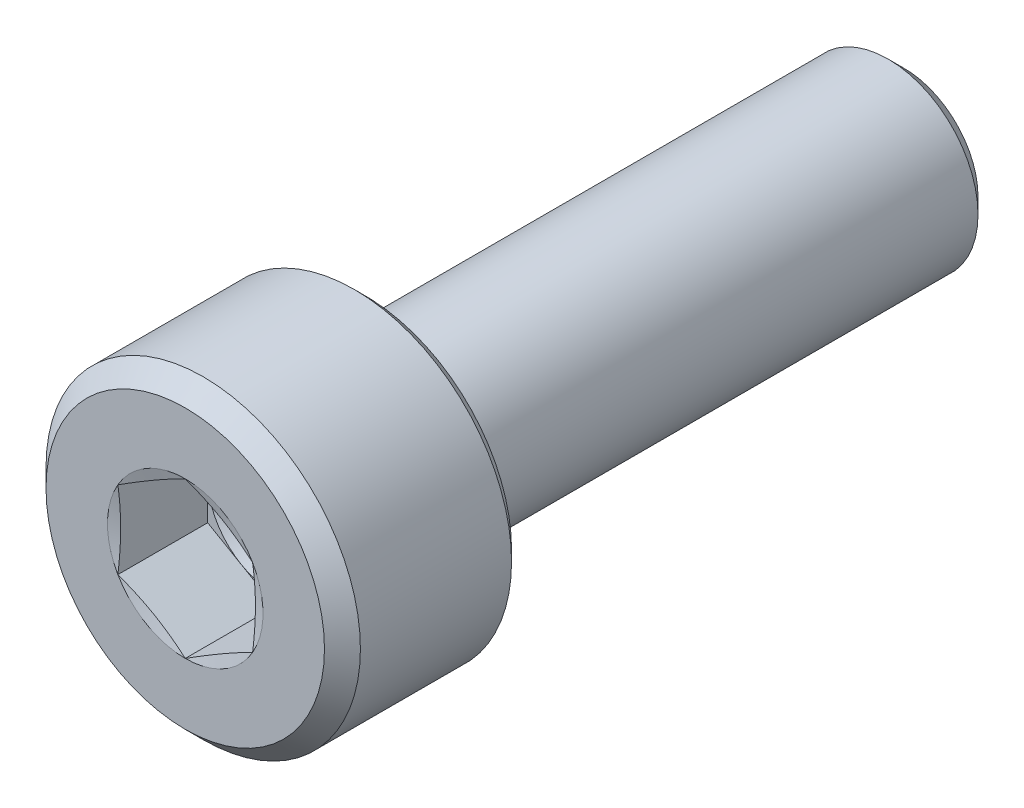
ISO-10303-21;
HEADER;
FILE_DESCRIPTION(('STEP AP214'),'2;1');
FILE_NAME('part.step','',(''),(''),'','','');
FILE_SCHEMA(('AUTOMOTIVE_DESIGN { 1 0 10303 214 1 1 1 1 }'));
ENDSEC;
DATA;
#1=APPLICATION_CONTEXT('core data for automotive mechanical design processes');
#2=APPLICATION_PROTOCOL_DEFINITION('international standard','automotive_design',2000,#1);
#3=PRODUCT_CONTEXT('',#1,'mechanical');
#4=PRODUCT('Part','Part','',(#3));
#5=PRODUCT_RELATED_PRODUCT_CATEGORY('part','',(#4));
#6=PRODUCT_DEFINITION_FORMATION('','',#4);
#7=PRODUCT_DEFINITION_CONTEXT('part definition',#1,'design');
#8=PRODUCT_DEFINITION('design','',#6,#7);
#9=PRODUCT_DEFINITION_SHAPE('','',#8);
#10=(LENGTH_UNIT() NAMED_UNIT(*) SI_UNIT(.MILLI.,.METRE.));
#11=(NAMED_UNIT(*) PLANE_ANGLE_UNIT() SI_UNIT($,.RADIAN.));
#12=(NAMED_UNIT(*) SI_UNIT($,.STERADIAN.) SOLID_ANGLE_UNIT());
#13=UNCERTAINTY_MEASURE_WITH_UNIT(LENGTH_MEASURE(1.E-05),#10,'distance_accuracy_value','');
#14=(GEOMETRIC_REPRESENTATION_CONTEXT(3) GLOBAL_UNCERTAINTY_ASSIGNED_CONTEXT((#13)) GLOBAL_UNIT_ASSIGNED_CONTEXT((#10,
#11,#12)) REPRESENTATION_CONTEXT('',''));
#15=CARTESIAN_POINT('',(0.,0.,0.));
#16=DIRECTION('',(0.,0.,1.));
#17=DIRECTION('',(1.,0.,0.));
#18=AXIS2_PLACEMENT_3D('',#15,#16,#17);
#19=CARTESIAN_POINT('',(0.,0.,0.));
#20=DIRECTION('',(0.,0.,-1.));
#21=DIRECTION('',(-1.,0.,0.));
#22=AXIS2_PLACEMENT_3D('',#19,#20,#21);
#23=PLANE('',#22);
#24=CARTESIAN_POINT('',(0.,0.,0.));
#25=DIRECTION('',(0.,0.,1.));
#26=DIRECTION('',(1.,0.,0.));
#27=AXIS2_PLACEMENT_3D('',#24,#25,#26);
#28=CIRCLE('',#27,3.1);
#29=CARTESIAN_POINT('',(3.1,0.,0.));
#30=VERTEX_POINT('',#29);
#31=EDGE_CURVE('E229',#30,#30,#28,.T.);
#32=ORIENTED_EDGE('',*,*,#31,.T.);
#33=EDGE_LOOP('',(#32));
#34=FACE_BOUND('',#33,.T.);
#35=CARTESIAN_POINT('',(0.,0.,0.));
#36=DIRECTION('',(0.,0.,1.));
#37=DIRECTION('',(1.,0.,0.));
#38=AXIS2_PLACEMENT_3D('',#35,#36,#37);
#39=CIRCLE('',#38,1.73205080756888);
#40=CARTESIAN_POINT('',(-1.5,-0.866025403784441,0.));
#41=VERTEX_POINT('',#40);
#42=CARTESIAN_POINT('',(0.,-1.73205080756888,0.));
#43=VERTEX_POINT('',#42);
#44=EDGE_CURVE('E155',#41,#43,#39,.T.);
#45=ORIENTED_EDGE('',*,*,#44,.F.);
#46=CARTESIAN_POINT('',(-1.5,0.86602540378444,0.));
#47=VERTEX_POINT('',#46);
#48=EDGE_CURVE('E154',#47,#41,#39,.T.);
#49=ORIENTED_EDGE('',*,*,#48,.F.);
#50=CARTESIAN_POINT('',(0.,1.73205080756888,0.));
#51=VERTEX_POINT('',#50);
#52=EDGE_CURVE('E121',#51,#47,#39,.T.);
#53=ORIENTED_EDGE('',*,*,#52,.F.);
#54=CARTESIAN_POINT('',(1.5,0.86602540378444,0.));
#55=VERTEX_POINT('',#54);
#56=EDGE_CURVE('E115',#55,#51,#39,.T.);
#57=ORIENTED_EDGE('',*,*,#56,.F.);
#58=CARTESIAN_POINT('',(1.5,-0.866025403784438,0.));
#59=VERTEX_POINT('',#58);
#60=EDGE_CURVE('E123',#59,#55,#39,.T.);
#61=ORIENTED_EDGE('',*,*,#60,.F.);
#62=EDGE_CURVE('E313',#43,#59,#39,.T.);
#63=ORIENTED_EDGE('',*,*,#62,.F.);
#64=EDGE_LOOP('',(#45,#49,#53,#57,#61,#63));
#65=FACE_BOUND('',#64,.T.);
#66=ADVANCED_FACE('F38',(#34,#65),#23,.F.);
#67=CARTESIAN_POINT('',(0.,0.,-0.4));
#68=DIRECTION('',(0.,0.,-1.));
#69=DIRECTION('',(-1.,0.,0.));
#70=AXIS2_PLACEMENT_3D('',#67,#68,#69);
#71=CONICAL_SURFACE('',#70,3.5,0.78539816339745);
#72=ORIENTED_EDGE('',*,*,#31,.F.);
#73=EDGE_LOOP('',(#72));
#74=FACE_BOUND('',#73,.T.);
#75=CARTESIAN_POINT('',(0.,0.,-0.4));
#76=DIRECTION('',(0.,0.,1.));
#77=DIRECTION('',(1.,0.,0.));
#78=AXIS2_PLACEMENT_3D('',#75,#76,#77);
#79=CIRCLE('',#78,3.5);
#80=CARTESIAN_POINT('',(3.5,0.,-0.4));
#81=VERTEX_POINT('',#80);
#82=EDGE_CURVE('E231',#81,#81,#79,.T.);
#83=ORIENTED_EDGE('',*,*,#82,.T.);
#84=EDGE_LOOP('',(#83));
#85=FACE_BOUND('',#84,.T.);
#86=ADVANCED_FACE('F220',(#74,#85),#71,.T.);
#87=CARTESIAN_POINT('',(0.,0.,0.));
#88=DIRECTION('',(0.,0.,1.));
#89=DIRECTION('',(1.,0.,0.));
#90=AXIS2_PLACEMENT_3D('',#87,#88,#89);
#91=CYLINDRICAL_SURFACE('',#90,3.5);
#92=ORIENTED_EDGE('',*,*,#82,.F.);
#93=EDGE_LOOP('',(#92));
#94=FACE_BOUND('',#93,.T.);
#95=CARTESIAN_POINT('',(0.,0.,-3.765));
#96=DIRECTION('',(0.,0.,1.));
#97=DIRECTION('',(1.,0.,0.));
#98=AXIS2_PLACEMENT_3D('',#95,#96,#97);
#99=CIRCLE('',#98,3.5);
#100=CARTESIAN_POINT('',(3.5,0.,-3.765));
#101=VERTEX_POINT('',#100);
#102=EDGE_CURVE('E234',#101,#101,#99,.T.);
#103=ORIENTED_EDGE('',*,*,#102,.T.);
#104=EDGE_LOOP('',(#103));
#105=FACE_BOUND('',#104,.T.);
#106=ADVANCED_FACE('F225',(#94,#105),#91,.T.);
#107=CARTESIAN_POINT('',(0.,0.,-4.));
#108=DIRECTION('',(0.,0.,1.));
#109=DIRECTION('',(1.,0.,0.));
#110=AXIS2_PLACEMENT_3D('',#107,#108,#109);
#111=CONICAL_SURFACE('',#110,3.265,0.78539816339745);
#112=ORIENTED_EDGE('',*,*,#102,.F.);
#113=EDGE_LOOP('',(#112));
#114=FACE_BOUND('',#113,.T.);
#115=CARTESIAN_POINT('',(0.,0.,-4.));
#116=DIRECTION('',(0.,0.,1.));
#117=DIRECTION('',(1.,0.,0.));
#118=AXIS2_PLACEMENT_3D('',#115,#116,#117);
#119=CIRCLE('',#118,3.265);
#120=CARTESIAN_POINT('',(3.265,0.,-4.));
#121=VERTEX_POINT('',#120);
#122=EDGE_CURVE('E239',#121,#121,#119,.T.);
#123=ORIENTED_EDGE('',*,*,#122,.T.);
#124=EDGE_LOOP('',(#123));
#125=FACE_BOUND('',#124,.T.);
#126=ADVANCED_FACE('F429',(#114,#125),#111,.T.);
#127=CARTESIAN_POINT('',(0.,3.265,-4.));
#128=DIRECTION('',(0.,0.,1.));
#129=DIRECTION('',(1.,0.,0.));
#130=AXIS2_PLACEMENT_3D('',#127,#128,#129);
#131=PLANE('',#130);
#132=ORIENTED_EDGE('',*,*,#122,.F.);
#133=EDGE_LOOP('',(#132));
#134=FACE_BOUND('',#133,.T.);
#135=CARTESIAN_POINT('',(0.,0.,-4.));
#136=DIRECTION('',(0.,0.,1.));
#137=DIRECTION('',(1.,0.,0.));
#138=AXIS2_PLACEMENT_3D('',#135,#136,#137);
#139=CIRCLE('',#138,2.35);
#140=CARTESIAN_POINT('',(2.35,0.,-4.));
#141=VERTEX_POINT('',#140);
#142=EDGE_CURVE('E242',#141,#141,#139,.T.);
#143=ORIENTED_EDGE('',*,*,#142,.T.);
#144=EDGE_LOOP('',(#143));
#145=FACE_BOUND('',#144,.T.);
#146=ADVANCED_FACE('F421',(#134,#145),#131,.F.);
#147=CARTESIAN_POINT('',(0.,0.,-4.2));
#148=DIRECTION('',(0.,0.,1.));
#149=DIRECTION('',(1.,0.,0.));
#150=AXIS2_PLACEMENT_3D('',#147,#148,#149);
#151=TOROIDAL_SURFACE('',#150,2.35,0.199999999999999);
#152=ORIENTED_EDGE('',*,*,#142,.F.);
#153=EDGE_LOOP('',(#152));
#154=FACE_BOUND('',#153,.T.);
#155=CARTESIAN_POINT('',(0.,0.,-4.12977531168232));
#156=DIRECTION('',(0.,0.,1.));
#157=DIRECTION('',(1.,0.,0.));
#158=AXIS2_PLACEMENT_3D('',#155,#156,#157);
#159=CIRCLE('',#158,2.16273416448619);
#160=CARTESIAN_POINT('',(2.16273416448619,0.,-4.12977531168232));
#161=VERTEX_POINT('',#160);
#162=EDGE_CURVE('E245',#161,#161,#159,.T.);
#163=ORIENTED_EDGE('',*,*,#162,.T.);
#164=EDGE_LOOP('',(#163));
#165=FACE_BOUND('',#164,.T.);
#166=ADVANCED_FACE('F413',(#154,#165),#151,.F.);
#167=CARTESIAN_POINT('',(0.,0.,-4.52977531168232));
#168=DIRECTION('',(0.,0.,1.));
#169=DIRECTION('',(1.,0.,0.));
#170=AXIS2_PLACEMENT_3D('',#167,#168,#169);
#171=CONICAL_SURFACE('',#170,2.01273416448619,0.358770670270571);
#172=ORIENTED_EDGE('',*,*,#162,.F.);
#173=EDGE_LOOP('',(#172));
#174=FACE_BOUND('',#173,.T.);
#175=CARTESIAN_POINT('',(0.,0.,-4.52977531168232));
#176=DIRECTION('',(0.,0.,1.));
#177=DIRECTION('',(1.,0.,0.));
#178=AXIS2_PLACEMENT_3D('',#175,#176,#177);
#179=CIRCLE('',#178,2.01273416448619);
#180=CARTESIAN_POINT('',(2.01273416448619,0.,-4.52977531168232));
#181=VERTEX_POINT('',#180);
#182=EDGE_CURVE('E248',#181,#181,#179,.T.);
#183=ORIENTED_EDGE('',*,*,#182,.T.);
#184=EDGE_LOOP('',(#183));
#185=FACE_BOUND('',#184,.T.);
#186=ADVANCED_FACE('F405',(#174,#185),#171,.T.);
#187=CARTESIAN_POINT('',(0.,0.,-4.6));
#188=DIRECTION('',(0.,0.,1.));
#189=DIRECTION('',(1.,0.,0.));
#190=AXIS2_PLACEMENT_3D('',#187,#188,#189);
#191=TOROIDAL_SURFACE('',#190,2.2,0.199999999999999);
#192=ORIENTED_EDGE('',*,*,#182,.F.);
#193=EDGE_LOOP('',(#192));
#194=FACE_BOUND('',#193,.T.);
#195=CARTESIAN_POINT('',(0.,0.,-4.6));
#196=DIRECTION('',(0.,0.,1.));
#197=DIRECTION('',(1.,0.,0.));
#198=AXIS2_PLACEMENT_3D('',#195,#196,#197);
#199=CIRCLE('',#198,2.);
#200=CARTESIAN_POINT('',(2.,0.,-4.6));
#201=VERTEX_POINT('',#200);
#202=EDGE_CURVE('E251',#201,#201,#199,.T.);
#203=ORIENTED_EDGE('',*,*,#202,.T.);
#204=EDGE_LOOP('',(#203));
#205=FACE_BOUND('',#204,.T.);
#206=ADVANCED_FACE('F397',(#194,#205),#191,.F.);
#207=CARTESIAN_POINT('',(0.,0.,0.));
#208=DIRECTION('',(0.,0.,1.));
#209=DIRECTION('',(1.,0.,0.));
#210=AXIS2_PLACEMENT_3D('',#207,#208,#209);
#211=CYLINDRICAL_SURFACE('',#210,2.);
#212=ORIENTED_EDGE('',*,*,#202,.F.);
#213=EDGE_LOOP('',(#212));
#214=FACE_BOUND('',#213,.T.);
#215=CARTESIAN_POINT('',(0.,0.,-15.65));
#216=DIRECTION('',(0.,0.,1.));
#217=DIRECTION('',(1.,0.,0.));
#218=AXIS2_PLACEMENT_3D('',#215,#216,#217);
#219=CIRCLE('',#218,2.);
#220=CARTESIAN_POINT('',(2.,0.,-15.65));
#221=VERTEX_POINT('',#220);
#222=EDGE_CURVE('E254',#221,#221,#219,.T.);
#223=ORIENTED_EDGE('',*,*,#222,.T.);
#224=EDGE_LOOP('',(#223));
#225=FACE_BOUND('',#224,.T.);
#226=ADVANCED_FACE('F388',(#214,#225),#211,.T.);
#227=CARTESIAN_POINT('',(0.,0.,-16.));
#228=DIRECTION('',(0.,0.,1.));
#229=DIRECTION('',(1.,0.,0.));
#230=AXIS2_PLACEMENT_3D('',#227,#228,#229);
#231=CONICAL_SURFACE('',#230,1.65,0.785398163397434);
#232=ORIENTED_EDGE('',*,*,#222,.F.);
#233=EDGE_LOOP('',(#232));
#234=FACE_BOUND('',#233,.T.);
#235=CARTESIAN_POINT('',(0.,0.,-16.));
#236=DIRECTION('',(0.,0.,1.));
#237=DIRECTION('',(1.,0.,0.));
#238=AXIS2_PLACEMENT_3D('',#235,#236,#237);
#239=CIRCLE('',#238,1.65);
#240=CARTESIAN_POINT('',(1.65,0.,-16.));
#241=VERTEX_POINT('',#240);
#242=EDGE_CURVE('E257',#241,#241,#239,.T.);
#243=ORIENTED_EDGE('',*,*,#242,.T.);
#244=EDGE_LOOP('',(#243));
#245=FACE_BOUND('',#244,.T.);
#246=ADVANCED_FACE('F380',(#234,#245),#231,.T.);
#247=CARTESIAN_POINT('',(0.,1.65,-16.));
#248=DIRECTION('',(0.,0.,1.));
#249=DIRECTION('',(1.,0.,0.));
#250=AXIS2_PLACEMENT_3D('',#247,#248,#249);
#251=PLANE('',#250);
#252=ORIENTED_EDGE('',*,*,#242,.F.);
#253=EDGE_LOOP('',(#252));
#254=FACE_BOUND('',#253,.T.);
#255=ADVANCED_FACE('F374',(#254),#251,.F.);
#256=CARTESIAN_POINT('',(0.,0.,-0.0621778264910692));
#257=DIRECTION('',(0.,0.,1.));
#258=DIRECTION('',(1.,0.,0.));
#259=AXIS2_PLACEMENT_3D('',#256,#257,#258);
#260=CONICAL_SURFACE('',#259,1.5,1.30899693899575);
#261=ORIENTED_EDGE('',*,*,#52,.T.);
#262=CARTESIAN_POINT('',(-1.5002,0.865909933730602,3.09432014802828E-05));
#263=CARTESIAN_POINT('',(-1.43789222061942,0.901883346928587,-0.00961367357160753));
#264=CARTESIAN_POINT('',(-1.37547144481682,0.937921998641243,-0.0183695040280942));
#265=CARTESIAN_POINT('',(-1.25040937601299,1.01012661773055,-0.0337528099860755));
#266=CARTESIAN_POINT('',(-1.18776800380528,1.04629263083708,-0.0403794203637019));
#267=CARTESIAN_POINT('',(-1.06264466889024,1.11853262193218,-0.0511173105510228));
#268=CARTESIAN_POINT('',(-1.00016355288116,1.15460611107929,-0.0552413999954297));
#269=CARTESIAN_POINT('',(-0.875121612727221,1.22679910888716,-0.0607713948192355));
#270=CARTESIAN_POINT('',(-0.81256080636361,1.26291860728191,-0.0621778264910689));
#271=CARTESIAN_POINT('',(-0.687439193636389,1.33515760407141,-0.0621778264910689));
#272=CARTESIAN_POINT('',(-0.624878387272779,1.37127710246616,-0.0607713948192355));
#273=CARTESIAN_POINT('',(-0.499836447118839,1.44347010027403,-0.0552413999954297));
#274=CARTESIAN_POINT('',(-0.437355331109757,1.47954358942114,-0.0511173105510227));
#275=CARTESIAN_POINT('',(-0.312231996194721,1.55178358051624,-0.0403794203637018));
#276=CARTESIAN_POINT('',(-0.249590623987014,1.58794959362277,-0.0337528099860754));
#277=CARTESIAN_POINT('',(-0.124528555183177,1.66015421271208,-0.0183695040280941));
#278=CARTESIAN_POINT('',(-0.0621077793805777,1.69619286442473,-0.00961367357160735));
#279=CARTESIAN_POINT('',(0.000200000000000538,1.73216627762272,3.09432014804724E-05));
#280=B_SPLINE_CURVE_WITH_KNOTS('',3,(#262,#263,#264,#265,#266,#267,#268,#269,#270,#271,#272,
#273,#274,#275,#276,#277,#278,#279),.UNSPECIFIED.,.F.,.F.,(4,2,2,2,2,2,2,2,4),(0.,
0.217782584290281,0.435653544301782,0.652399669875338,0.869103816917188,1.08580796395904,
1.30255408953259,1.52042504954409,1.73820763383438),.UNSPECIFIED.);
#281=EDGE_CURVE('E11',#47,#51,#280,.T.);
#282=ORIENTED_EDGE('',*,*,#281,.T.);
#283=EDGE_LOOP('',(#261,#282));
#284=FACE_BOUND('',#283,.T.);
#285=ADVANCED_FACE('F127',(#284),#260,.F.);
#286=CARTESIAN_POINT('',(-1.5,-2.28964517247226,0.269339250493358));
#287=CARTESIAN_POINT('',(-1.5,-2.22160925580753,0.254092485074887));
#288=CARTESIAN_POINT('',(-1.5,-2.15353089636947,0.239034964401491));
#289=CARTESIAN_POINT('',(-1.5,-2.01726808230002,0.209394014326251));
#290=CARTESIAN_POINT('',(-1.5,-1.94908362321089,0.194810605440343));
#291=CARTESIAN_POINT('',(-1.5,-1.74421629402713,0.15188930467263));
#292=CARTESIAN_POINT('',(-1.5,-1.60735081315243,0.124410160848443));
#293=CARTESIAN_POINT('',(-1.5,-1.33404872260703,0.0731505368877311));
#294=CARTESIAN_POINT('',(-1.5,-1.19761743420633,0.0493422393460058));
#295=CARTESIAN_POINT('',(-1.5,-0.923938172131804,0.00699912407182039));
#296=CARTESIAN_POINT('',(-1.5,-0.786690344875856,-0.0115366116465929));
#297=CARTESIAN_POINT('',(-1.5,-0.509744520865001,-0.0409708681025398));
#298=CARTESIAN_POINT('',(-1.5,-0.370036362636702,-0.0517807181835124));
#299=CARTESIAN_POINT('',(-1.5,-0.160199252563518,-0.0603214648098066));
#300=CARTESIAN_POINT('',(-1.5,-0.0902193139362214,-0.0618897497676771));
#301=CARTESIAN_POINT('',(-1.5,0.049751791494376,-0.0623927733659913));
#302=CARTESIAN_POINT('',(-1.5,0.119742958288953,-0.0613275140426648));
#303=CARTESIAN_POINT('',(-1.5,0.259888881116302,-0.0566175514896631));
#304=CARTESIAN_POINT('',(-1.5,0.330043318264885,-0.0529635706300794));
#305=CARTESIAN_POINT('',(-1.5,0.470190940626507,-0.0432854694959674));
#306=CARTESIAN_POINT('',(-1.5,0.540184111252621,-0.0372611426780542));
#307=CARTESIAN_POINT('',(-1.5,0.749926987666925,-0.0160904435214203));
#308=CARTESIAN_POINT('',(-1.5,0.88936353865627,0.0021504551344671));
#309=CARTESIAN_POINT('',(-1.5,1.15801626262229,0.042848348608772));
#310=CARTESIAN_POINT('',(-1.5,1.28729075030016,0.0649405727898832));
#311=CARTESIAN_POINT('',(-1.5,1.54524807848696,0.11239508941207));
#312=CARTESIAN_POINT('',(-1.5,1.67393084218421,0.137757794638382));
#313=CARTESIAN_POINT('',(-1.5,1.9308654649173,0.190676592918979));
#314=CARTESIAN_POINT('',(-1.5,2.05911723183815,0.218233127195528));
#315=CARTESIAN_POINT('',(-1.5,2.31529096225887,0.274842718879562));
#316=CARTESIAN_POINT('',(-1.5,2.44321291887911,0.303895807243219));
#317=CARTESIAN_POINT('',(-1.5,2.69755167278246,0.362760576516848));
#318=CARTESIAN_POINT('',(-1.5,2.82397086776101,0.392561944472507));
#319=CARTESIAN_POINT('',(-1.5,3.07663292781285,0.452911245733353));
#320=CARTESIAN_POINT('',(-1.5,3.20287578964328,0.483459192582276));
#321=CARTESIAN_POINT('',(-1.5,3.45507130559321,0.545068721241145));
#322=CARTESIAN_POINT('',(-1.5,3.58102412567918,0.576129625174751));
#323=CARTESIAN_POINT('',(-1.5,3.83282000513678,0.638675885363819));
#324=CARTESIAN_POINT('',(-1.5,3.95866306798554,0.670161227611327));
#325=CARTESIAN_POINT('',(-1.5,4.08446786908827,0.70179695066207));
#326=B_SPLINE_CURVE_WITH_KNOTS('',3,(#286,#287,#288,#289,#290,#291,#292,#293,#294,#295,#296,
#297,#298,#299,#300,#301,#302,#303,#304,#305,#306,#307,#308,#309,#310,#311,#312,#313,#314,#315,
#316,#317,#318,#319,#320,#321,#322,#323,#324,#325),.UNSPECIFIED.,.F.,.F.,(4,2,2,2,2,2,2,2,2,2,2,
2,2,2,2,2,2,2,2,4),(0.,0.209169579296721,0.418348197839629,0.837109447697196,1.25252230864062,
1.66786279927901,2.08789680755374,2.29784449547574,2.50779202106835,2.71849580165408,
2.92921794627363,3.35089158040197,3.74428720392395,4.13773252874107,4.53125718404496,
4.92478998266471,5.31443997631384,5.70409704388357,6.09327490648975,6.48243995615359),.UNSPECIFIED.);
#327=EDGE_CURVE('E120',#41,#47,#326,.T.);
#328=ORIENTED_EDGE('',*,*,#327,.T.);
#329=ORIENTED_EDGE('',*,*,#48,.T.);
#330=EDGE_LOOP('',(#328,#329));
#331=FACE_BOUND('',#330,.T.);
#332=ADVANCED_FACE('F361',(#331),#260,.F.);
#333=CARTESIAN_POINT('',(0.000199999999999819,-1.73216627762271,3.09432014800229E-05));
#334=CARTESIAN_POINT('',(-0.0621077793805785,-1.69619286442473,-0.00961367357160781));
#335=CARTESIAN_POINT('',(-0.124528555183178,-1.66015421271207,-0.0183695040280945));
#336=CARTESIAN_POINT('',(-0.249590623987014,-1.58794959362277,-0.0337528099860759));
#337=CARTESIAN_POINT('',(-0.312231996194721,-1.55178358051624,-0.0403794203637023));
#338=CARTESIAN_POINT('',(-0.437355331109758,-1.47954358942114,-0.0511173105510232));
#339=CARTESIAN_POINT('',(-0.499836447118839,-1.44347010027403,-0.0552413999954301));
#340=CARTESIAN_POINT('',(-0.624878387272779,-1.37127710246616,-0.0607713948192359));
#341=CARTESIAN_POINT('',(-0.68743919363639,-1.33515760407141,-0.0621778264910694));
#342=CARTESIAN_POINT('',(-0.81256080636361,-1.26291860728191,-0.0621778264910694));
#343=CARTESIAN_POINT('',(-0.875121612727221,-1.22679910888716,-0.0607713948192359));
#344=CARTESIAN_POINT('',(-1.00016355288116,-1.15460611107929,-0.0552413999954301));
#345=CARTESIAN_POINT('',(-1.06264466889024,-1.11853262193217,-0.0511173105510231));
#346=CARTESIAN_POINT('',(-1.18776800380528,-1.04629263083707,-0.0403794203637023));
#347=CARTESIAN_POINT('',(-1.25040937601299,-1.01012661773055,-0.0337528099860759));
#348=CARTESIAN_POINT('',(-1.37547144481682,-0.937921998641241,-0.0183695040280945));
#349=CARTESIAN_POINT('',(-1.43789222061942,-0.901883346928585,-0.00961367357160784));
#350=CARTESIAN_POINT('',(-1.5002,-0.8659099337306,3.09432014799995E-05));
#351=B_SPLINE_CURVE_WITH_KNOTS('',3,(#333,#334,#335,#336,#337,#338,#339,#340,#341,#342,#343,
#344,#345,#346,#347,#348,#349,#350),.UNSPECIFIED.,.F.,.F.,(4,2,2,2,2,2,2,2,4),(0.,
0.217782584290281,0.435653544301782,0.652399669875338,0.869103816917187,1.08580796395904,
1.30255408953259,1.52042504954409,1.73820763383437),.UNSPECIFIED.);
#352=EDGE_CURVE('E163',#43,#41,#351,.T.);
#353=ORIENTED_EDGE('',*,*,#352,.T.);
#354=ORIENTED_EDGE('',*,*,#44,.T.);
#355=EDGE_LOOP('',(#353,#354));
#356=FACE_BOUND('',#355,.T.);
#357=ADVANCED_FACE('F355',(#356),#260,.F.);
#358=CARTESIAN_POINT('',(1.5002,-0.865909933730601,3.09432014800545E-05));
#359=CARTESIAN_POINT('',(1.43789222061942,-0.901883346928586,-0.00961367357160779));
#360=CARTESIAN_POINT('',(1.37547144481682,-0.937921998641241,-0.0183695040280945));
#361=CARTESIAN_POINT('',(1.25040937601299,-1.01012661773055,-0.0337528099860758));
#362=CARTESIAN_POINT('',(1.18776800380528,-1.04629263083708,-0.0403794203637023));
#363=CARTESIAN_POINT('',(1.06264466889024,-1.11853262193217,-0.0511173105510231));
#364=CARTESIAN_POINT('',(1.00016355288116,-1.15460611107929,-0.0552413999954301));
#365=CARTESIAN_POINT('',(0.875121612727221,-1.22679910888716,-0.0607713948192359));
#366=CARTESIAN_POINT('',(0.81256080636361,-1.26291860728191,-0.0621778264910693));
#367=CARTESIAN_POINT('',(0.687439193636389,-1.33515760407141,-0.0621778264910693));
#368=CARTESIAN_POINT('',(0.624878387272779,-1.37127710246616,-0.0607713948192359));
#369=CARTESIAN_POINT('',(0.499836447118839,-1.44347010027403,-0.0552413999954301));
#370=CARTESIAN_POINT('',(0.437355331109758,-1.47954358942114,-0.0511173105510231));
#371=CARTESIAN_POINT('',(0.312231996194721,-1.55178358051624,-0.0403794203637023));
#372=CARTESIAN_POINT('',(0.249590623987014,-1.58794959362277,-0.0337528099860758));
#373=CARTESIAN_POINT('',(0.124528555183178,-1.66015421271207,-0.0183695040280946));
#374=CARTESIAN_POINT('',(0.0621077793805782,-1.69619286442473,-0.00961367357160789));
#375=CARTESIAN_POINT('',(-0.000200000000000048,-1.73216627762271,3.09432014798939E-05));
#376=B_SPLINE_CURVE_WITH_KNOTS('',3,(#358,#359,#360,#361,#362,#363,#364,#365,#366,#367,#368,
#369,#370,#371,#372,#373,#374,#375),.UNSPECIFIED.,.F.,.F.,(4,2,2,2,2,2,2,2,4),(0.,
0.217782584290281,0.435653544301782,0.652399669875337,0.869103816917187,1.08580796395904,
1.30255408953259,1.52042504954409,1.73820763383437),.UNSPECIFIED.);
#377=EDGE_CURVE('E183',#59,#43,#376,.T.);
#378=ORIENTED_EDGE('',*,*,#377,.T.);
#379=ORIENTED_EDGE('',*,*,#62,.T.);
#380=EDGE_LOOP('',(#378,#379));
#381=FACE_BOUND('',#380,.T.);
#382=ADVANCED_FACE('F349',(#381),#260,.F.);
#383=CARTESIAN_POINT('',(1.5,-2.28964517247227,0.269339250493358));
#384=CARTESIAN_POINT('',(1.5,-2.22160925580753,0.254092485074887));
#385=CARTESIAN_POINT('',(1.5,-2.15353089636947,0.239034964401491));
#386=CARTESIAN_POINT('',(1.5,-2.01726808230003,0.209394014326251));
#387=CARTESIAN_POINT('',(1.5,-1.94908362321089,0.194810605440343));
#388=CARTESIAN_POINT('',(1.5,-1.74421629402713,0.15188930467263));
#389=CARTESIAN_POINT('',(1.5,-1.60735081315243,0.124410160848443));
#390=CARTESIAN_POINT('',(1.5,-1.33404872260703,0.0731505368877311));
#391=CARTESIAN_POINT('',(1.5,-1.19761743420633,0.0493422393460058));
#392=CARTESIAN_POINT('',(1.5,-0.923938172131805,0.00699912407182037));
#393=CARTESIAN_POINT('',(1.5,-0.786690344875857,-0.0115366116465929));
#394=CARTESIAN_POINT('',(1.5,-0.509744520865002,-0.0409708681025397));
#395=CARTESIAN_POINT('',(1.5,-0.370036362636703,-0.0517807181835124));
#396=CARTESIAN_POINT('',(1.5,-0.160199252563519,-0.0603214648098066));
#397=CARTESIAN_POINT('',(1.5,-0.0902193139362225,-0.0618897497676772));
#398=CARTESIAN_POINT('',(1.5,0.049751791494375,-0.0623927733659914));
#399=CARTESIAN_POINT('',(1.5,0.119742958288952,-0.0613275140426649));
#400=CARTESIAN_POINT('',(1.5,0.259888881116301,-0.0566175514896632));
#401=CARTESIAN_POINT('',(1.5,0.330043318264884,-0.0529635706300795));
#402=CARTESIAN_POINT('',(1.5,0.470190940626506,-0.0432854694959675));
#403=CARTESIAN_POINT('',(1.5,0.54018411125262,-0.0372611426780543));
#404=CARTESIAN_POINT('',(1.5,0.749926987666924,-0.0160904435214204));
#405=CARTESIAN_POINT('',(1.5,0.889363538656269,0.00215045513446702));
#406=CARTESIAN_POINT('',(1.5,1.15801626262229,0.0428483486087719));
#407=CARTESIAN_POINT('',(1.5,1.28729075030016,0.0649405727898832));
#408=CARTESIAN_POINT('',(1.5,1.54524807848696,0.11239508941207));
#409=CARTESIAN_POINT('',(1.5,1.67393084218421,0.137757794638382));
#410=CARTESIAN_POINT('',(1.5,1.9308654649173,0.19067659291898));
#411=CARTESIAN_POINT('',(1.5,2.05911723183815,0.218233127195528));
#412=CARTESIAN_POINT('',(1.5,2.31529096225887,0.274842718879562));
#413=CARTESIAN_POINT('',(1.5,2.44321291887912,0.303895807243219));
#414=CARTESIAN_POINT('',(1.5,2.69755167278246,0.362760576516849));
#415=CARTESIAN_POINT('',(1.5,2.82397086776101,0.392561944472508));
#416=CARTESIAN_POINT('',(1.5,3.07663292781285,0.452911245733354));
#417=CARTESIAN_POINT('',(1.5,3.20287578964328,0.483459192582276));
#418=CARTESIAN_POINT('',(1.5,3.45507130559321,0.545068721241145));
#419=CARTESIAN_POINT('',(1.5,3.58102412567918,0.576129625174751));
#420=CARTESIAN_POINT('',(1.5,3.83282000513678,0.63867588536382));
#421=CARTESIAN_POINT('',(1.5,3.95866306798554,0.670161227611328));
#422=CARTESIAN_POINT('',(1.5,4.08446786908828,0.70179695066207));
#423=B_SPLINE_CURVE_WITH_KNOTS('',3,(#383,#384,#385,#386,#387,#388,#389,#390,#391,#392,#393,
#394,#395,#396,#397,#398,#399,#400,#401,#402,#403,#404,#405,#406,#407,#408,#409,#410,#411,#412,
#413,#414,#415,#416,#417,#418,#419,#420,#421,#422),.UNSPECIFIED.,.F.,.F.,(4,2,2,2,2,2,2,2,2,2,2,
2,2,2,2,2,2,2,2,4),(0.,0.209169579296721,0.418348197839629,0.837109447697197,1.25252230864062,
1.66786279927901,2.08789680755374,2.29784449547574,2.50779202106835,2.71849580165408,
2.92921794627363,3.35089158040197,3.74428720392395,4.13773252874107,4.53125718404496,
4.92478998266471,5.31443997631385,5.70409704388357,6.09327490648975,6.48243995615359),.UNSPECIFIED.);
#424=EDGE_CURVE('E63',#55,#59,#423,.F.);
#425=ORIENTED_EDGE('',*,*,#424,.T.);
#426=ORIENTED_EDGE('',*,*,#60,.T.);
#427=EDGE_LOOP('',(#425,#426));
#428=FACE_BOUND('',#427,.T.);
#429=ADVANCED_FACE('F176',(#428),#260,.F.);
#430=CARTESIAN_POINT('',(-0.000199999999999667,1.73216627762272,3.09432014804973E-05));
#431=CARTESIAN_POINT('',(0.0621077793805787,1.69619286442473,-0.0096136735716074));
#432=CARTESIAN_POINT('',(0.124528555183178,1.66015421271208,-0.0183695040280941));
#433=CARTESIAN_POINT('',(0.249590623987014,1.58794959362277,-0.0337528099860754));
#434=CARTESIAN_POINT('',(0.312231996194721,1.55178358051624,-0.0403794203637018));
#435=CARTESIAN_POINT('',(0.437355331109758,1.47954358942114,-0.0511173105510226));
#436=CARTESIAN_POINT('',(0.499836447118839,1.44347010027403,-0.0552413999954297));
#437=CARTESIAN_POINT('',(0.624878387272779,1.37127710246616,-0.0607713948192354));
#438=CARTESIAN_POINT('',(0.68743919363639,1.33515760407141,-0.0621778264910688));
#439=CARTESIAN_POINT('',(0.812560806363611,1.26291860728191,-0.0621778264910688));
#440=CARTESIAN_POINT('',(0.875121612727221,1.22679910888716,-0.0607713948192354));
#441=CARTESIAN_POINT('',(1.00016355288116,1.15460611107929,-0.0552413999954297));
#442=CARTESIAN_POINT('',(1.06264466889024,1.11853262193218,-0.0511173105510227));
#443=CARTESIAN_POINT('',(1.18776800380528,1.04629263083708,-0.0403794203637019));
#444=CARTESIAN_POINT('',(1.25040937601299,1.01012661773055,-0.0337528099860755));
#445=CARTESIAN_POINT('',(1.37547144481682,0.937921998641243,-0.0183695040280941));
#446=CARTESIAN_POINT('',(1.43789222061942,0.901883346928587,-0.00961367357160743));
#447=CARTESIAN_POINT('',(1.5002,0.865909933730602,3.09432014803357E-05));
#448=B_SPLINE_CURVE_WITH_KNOTS('',3,(#430,#431,#432,#433,#434,#435,#436,#437,#438,#439,#440,
#441,#442,#443,#444,#445,#446,#447),.UNSPECIFIED.,.F.,.F.,(4,2,2,2,2,2,2,2,4),(0.,
0.217782584290281,0.435653544301782,0.652399669875338,0.869103816917187,1.08580796395904,
1.30255408953259,1.52042504954409,1.73820763383437),.UNSPECIFIED.);
#449=EDGE_CURVE('E57',#51,#55,#448,.T.);
#450=ORIENTED_EDGE('',*,*,#449,.T.);
#451=ORIENTED_EDGE('',*,*,#56,.T.);
#452=EDGE_LOOP('',(#450,#451));
#453=FACE_BOUND('',#452,.T.);
#454=ADVANCED_FACE('F116',(#453),#260,.F.);
#455=CARTESIAN_POINT('',(0.,0.,-2.86602540378443));
#456=DIRECTION('',(0.,0.,1.));
#457=DIRECTION('',(1.,0.,0.));
#458=AXIS2_PLACEMENT_3D('',#455,#456,#457);
#459=CONICAL_SURFACE('',#458,0.,1.0471975511966);
#460=CARTESIAN_POINT('',(0.,0.,-2.));
#461=DIRECTION('',(0.,0.,1.));
#462=DIRECTION('',(1.,0.,0.));
#463=AXIS2_PLACEMENT_3D('',#460,#461,#462);
#464=CIRCLE('',#463,1.5);
#465=CARTESIAN_POINT('',(1.5,0.,-2.));
#466=VERTEX_POINT('',#465);
#467=CARTESIAN_POINT('',(0.75,1.29903810567666,-2.));
#468=VERTEX_POINT('',#467);
#469=EDGE_CURVE('E143',#466,#468,#464,.T.);
#470=ORIENTED_EDGE('',*,*,#469,.T.);
#471=CARTESIAN_POINT('',(-0.75,1.29903810567666,-2.));
#472=VERTEX_POINT('',#471);
#473=EDGE_CURVE('E51',#468,#472,#464,.T.);
#474=ORIENTED_EDGE('',*,*,#473,.T.);
#475=CARTESIAN_POINT('',(-1.5,0.,-2.));
#476=VERTEX_POINT('',#475);
#477=EDGE_CURVE('E294',#472,#476,#464,.T.);
#478=ORIENTED_EDGE('',*,*,#477,.T.);
#479=CARTESIAN_POINT('',(-0.75,-1.29903810567666,-2.));
#480=VERTEX_POINT('',#479);
#481=EDGE_CURVE('E296',#476,#480,#464,.T.);
#482=ORIENTED_EDGE('',*,*,#481,.T.);
#483=CARTESIAN_POINT('',(0.749999999999999,-1.29903810567666,-2.));
#484=VERTEX_POINT('',#483);
#485=EDGE_CURVE('E232',#480,#484,#464,.T.);
#486=ORIENTED_EDGE('',*,*,#485,.T.);
#487=EDGE_CURVE('E230',#484,#466,#464,.T.);
#488=ORIENTED_EDGE('',*,*,#487,.T.);
#489=EDGE_LOOP('',(#470,#474,#478,#482,#486,#488));
#490=FACE_BOUND('',#489,.T.);
#491=CARTESIAN_POINT('',(0.,0.,-2.86602540378443));
#492=VERTEX_POINT('',#491);
#493=VERTEX_LOOP('',#492);
#494=FACE_BOUND('',#493,.T.);
#495=ADVANCED_FACE('F175',(#490,#494),#459,.F.);
#496=CARTESIAN_POINT('',(0.,0.,-2.));
#497=DIRECTION('',(0.,0.,1.));
#498=DIRECTION('',(1.,0.,0.));
#499=AXIS2_PLACEMENT_3D('',#496,#497,#498);
#500=PLANE('',#499);
#501=ORIENTED_EDGE('',*,*,#469,.F.);
#502=DIRECTION('',(0.,1.,0.));
#503=VECTOR('',#502,1.);
#504=CARTESIAN_POINT('',(1.5,-0.866025403784439,-2.));
#505=LINE('',#504,#503);
#506=CARTESIAN_POINT('',(1.5,0.86602540378444,-2.));
#507=VERTEX_POINT('',#506);
#508=EDGE_CURVE('E273',#466,#507,#505,.T.);
#509=ORIENTED_EDGE('',*,*,#508,.T.);
#510=DIRECTION('',(-0.866025403784439,0.5,0.));
#511=VECTOR('',#510,1.);
#512=CARTESIAN_POINT('',(1.5,0.86602540378444,-2.));
#513=LINE('',#512,#511);
#514=EDGE_CURVE('E288',#507,#468,#513,.T.);
#515=ORIENTED_EDGE('',*,*,#514,.T.);
#516=EDGE_LOOP('',(#501,#509,#515));
#517=FACE_BOUND('',#516,.T.);
#518=ADVANCED_FACE('F318',(#517),#500,.T.);
#519=ORIENTED_EDGE('',*,*,#487,.F.);
#520=DIRECTION('',(0.866025403784439,0.5,0.));
#521=VECTOR('',#520,1.);
#522=CARTESIAN_POINT('',(0.,-1.73205080756888,-2.));
#523=LINE('',#522,#521);
#524=CARTESIAN_POINT('',(1.5,-0.866025403784439,-2.));
#525=VERTEX_POINT('',#524);
#526=EDGE_CURVE('E277',#484,#525,#523,.T.);
#527=ORIENTED_EDGE('',*,*,#526,.T.);
#528=EDGE_CURVE('E150',#525,#466,#505,.T.);
#529=ORIENTED_EDGE('',*,*,#528,.T.);
#530=EDGE_LOOP('',(#519,#527,#529));
#531=FACE_BOUND('',#530,.T.);
#532=ADVANCED_FACE('F206',(#531),#500,.T.);
#533=ORIENTED_EDGE('',*,*,#485,.F.);
#534=DIRECTION('',(0.866025403784439,-0.5,0.));
#535=VECTOR('',#534,1.);
#536=CARTESIAN_POINT('',(-1.5,-0.866025403784438,-2.));
#537=LINE('',#536,#535);
#538=CARTESIAN_POINT('',(0.,-1.73205080756888,-2.));
#539=VERTEX_POINT('',#538);
#540=EDGE_CURVE('E281',#480,#539,#537,.T.);
#541=ORIENTED_EDGE('',*,*,#540,.T.);
#542=EDGE_CURVE('E274',#539,#484,#523,.T.);
#543=ORIENTED_EDGE('',*,*,#542,.T.);
#544=EDGE_LOOP('',(#533,#541,#543));
#545=FACE_BOUND('',#544,.T.);
#546=ADVANCED_FACE('F309',(#545),#500,.T.);
#547=ORIENTED_EDGE('',*,*,#481,.F.);
#548=DIRECTION('',(0.,-1.,0.));
#549=VECTOR('',#548,1.);
#550=CARTESIAN_POINT('',(-1.5,0.86602540378444,-2.));
#551=LINE('',#550,#549);
#552=CARTESIAN_POINT('',(-1.5,-0.866025403784438,-2.));
#553=VERTEX_POINT('',#552);
#554=EDGE_CURVE('E285',#476,#553,#551,.T.);
#555=ORIENTED_EDGE('',*,*,#554,.T.);
#556=EDGE_CURVE('E278',#553,#480,#537,.T.);
#557=ORIENTED_EDGE('',*,*,#556,.T.);
#558=EDGE_LOOP('',(#547,#555,#557));
#559=FACE_BOUND('',#558,.T.);
#560=ADVANCED_FACE('F323',(#559),#500,.T.);
#561=ORIENTED_EDGE('',*,*,#473,.F.);
#562=CARTESIAN_POINT('',(0.,1.73205080756888,-2.));
#563=VERTEX_POINT('',#562);
#564=EDGE_CURVE('E290',#468,#563,#513,.T.);
#565=ORIENTED_EDGE('',*,*,#564,.T.);
#566=DIRECTION('',(-0.866025403784439,-0.5,0.));
#567=VECTOR('',#566,1.);
#568=CARTESIAN_POINT('',(0.,1.73205080756888,-2.));
#569=LINE('',#568,#567);
#570=EDGE_CURVE('E148',#563,#472,#569,.T.);
#571=ORIENTED_EDGE('',*,*,#570,.T.);
#572=EDGE_LOOP('',(#561,#565,#571));
#573=FACE_BOUND('',#572,.T.);
#574=ADVANCED_FACE('F320',(#573),#500,.T.);
#575=ORIENTED_EDGE('',*,*,#477,.F.);
#576=CARTESIAN_POINT('',(-1.5,0.86602540378444,-2.));
#577=VERTEX_POINT('',#576);
#578=EDGE_CURVE('E287',#472,#577,#569,.T.);
#579=ORIENTED_EDGE('',*,*,#578,.T.);
#580=EDGE_CURVE('E282',#577,#476,#551,.T.);
#581=ORIENTED_EDGE('',*,*,#580,.T.);
#582=EDGE_LOOP('',(#575,#579,#581));
#583=FACE_BOUND('',#582,.T.);
#584=ADVANCED_FACE('F322',(#583),#500,.T.);
#585=CARTESIAN_POINT('',(0.,1.73205080756888,-2.));
#586=DIRECTION('',(-0.5,0.866025403784439,0.));
#587=DIRECTION('',(-0.866025403784439,-0.5,0.));
#588=AXIS2_PLACEMENT_3D('',#585,#586,#587);
#589=PLANE('',#588);
#590=ORIENTED_EDGE('',*,*,#281,.F.);
#591=DIRECTION('',(0.,0.,1.));
#592=VECTOR('',#591,1.);
#593=CARTESIAN_POINT('',(-1.5,0.86602540378444,-2.));
#594=LINE('',#593,#592);
#595=EDGE_CURVE('E149',#577,#47,#594,.T.);
#596=ORIENTED_EDGE('',*,*,#595,.F.);
#597=ORIENTED_EDGE('',*,*,#578,.F.);
#598=ORIENTED_EDGE('',*,*,#570,.F.);
#599=DIRECTION('',(0.,0.,1.));
#600=VECTOR('',#599,1.);
#601=CARTESIAN_POINT('',(0.,1.73205080756888,-2.));
#602=LINE('',#601,#600);
#603=EDGE_CURVE('E138',#563,#51,#602,.T.);
#604=ORIENTED_EDGE('',*,*,#603,.T.);
#605=EDGE_LOOP('',(#590,#596,#597,#598,#604));
#606=FACE_BOUND('',#605,.T.);
#607=ADVANCED_FACE('F145',(#606),#589,.F.);
#608=CARTESIAN_POINT('',(-1.5,0.86602540378444,-2.));
#609=DIRECTION('',(-1.,0.,0.));
#610=DIRECTION('',(0.,0.,1.));
#611=AXIS2_PLACEMENT_3D('',#608,#609,#610);
#612=PLANE('',#611);
#613=ORIENTED_EDGE('',*,*,#327,.F.);
#614=DIRECTION('',(0.,0.,1.));
#615=VECTOR('',#614,1.);
#616=CARTESIAN_POINT('',(-1.5,-0.866025403784438,-2.));
#617=LINE('',#616,#615);
#618=EDGE_CURVE('E261',#553,#41,#617,.T.);
#619=ORIENTED_EDGE('',*,*,#618,.F.);
#620=ORIENTED_EDGE('',*,*,#554,.F.);
#621=ORIENTED_EDGE('',*,*,#580,.F.);
#622=ORIENTED_EDGE('',*,*,#595,.T.);
#623=EDGE_LOOP('',(#613,#619,#620,#621,#622));
#624=FACE_BOUND('',#623,.T.);
#625=ADVANCED_FACE('F170',(#624),#612,.F.);
#626=CARTESIAN_POINT('',(-1.5,-0.866025403784438,-2.));
#627=DIRECTION('',(-0.5,-0.866025403784439,0.));
#628=DIRECTION('',(0.866025403784439,-0.5,0.));
#629=AXIS2_PLACEMENT_3D('',#626,#627,#628);
#630=PLANE('',#629);
#631=ORIENTED_EDGE('',*,*,#352,.F.);
#632=DIRECTION('',(0.,0.,1.));
#633=VECTOR('',#632,1.);
#634=CARTESIAN_POINT('',(0.,-1.73205080756888,-2.));
#635=LINE('',#634,#633);
#636=EDGE_CURVE('E264',#539,#43,#635,.T.);
#637=ORIENTED_EDGE('',*,*,#636,.F.);
#638=ORIENTED_EDGE('',*,*,#540,.F.);
#639=ORIENTED_EDGE('',*,*,#556,.F.);
#640=ORIENTED_EDGE('',*,*,#618,.T.);
#641=EDGE_LOOP('',(#631,#637,#638,#639,#640));
#642=FACE_BOUND('',#641,.T.);
#643=ADVANCED_FACE('F209',(#642),#630,.F.);
#644=CARTESIAN_POINT('',(0.,-1.73205080756888,-2.));
#645=DIRECTION('',(0.5,-0.866025403784439,0.));
#646=DIRECTION('',(0.866025403784439,0.5,0.));
#647=AXIS2_PLACEMENT_3D('',#644,#645,#646);
#648=PLANE('',#647);
#649=ORIENTED_EDGE('',*,*,#377,.F.);
#650=DIRECTION('',(0.,0.,1.));
#651=VECTOR('',#650,1.);
#652=CARTESIAN_POINT('',(1.5,-0.866025403784439,-2.));
#653=LINE('',#652,#651);
#654=EDGE_CURVE('E267',#525,#59,#653,.T.);
#655=ORIENTED_EDGE('',*,*,#654,.F.);
#656=ORIENTED_EDGE('',*,*,#526,.F.);
#657=ORIENTED_EDGE('',*,*,#542,.F.);
#658=ORIENTED_EDGE('',*,*,#636,.T.);
#659=EDGE_LOOP('',(#649,#655,#656,#657,#658));
#660=FACE_BOUND('',#659,.T.);
#661=ADVANCED_FACE('F204',(#660),#648,.F.);
#662=CARTESIAN_POINT('',(1.5,-0.866025403784439,-2.));
#663=DIRECTION('',(1.,0.,0.));
#664=DIRECTION('',(0.,1.,0.));
#665=AXIS2_PLACEMENT_3D('',#662,#663,#664);
#666=PLANE('',#665);
#667=ORIENTED_EDGE('',*,*,#424,.F.);
#668=DIRECTION('',(0.,0.,1.));
#669=VECTOR('',#668,1.);
#670=CARTESIAN_POINT('',(1.5,0.86602540378444,-2.));
#671=LINE('',#670,#669);
#672=EDGE_CURVE('E142',#507,#55,#671,.T.);
#673=ORIENTED_EDGE('',*,*,#672,.F.);
#674=ORIENTED_EDGE('',*,*,#508,.F.);
#675=ORIENTED_EDGE('',*,*,#528,.F.);
#676=ORIENTED_EDGE('',*,*,#654,.T.);
#677=EDGE_LOOP('',(#667,#673,#674,#675,#676));
#678=FACE_BOUND('',#677,.T.);
#679=ADVANCED_FACE('F201',(#678),#666,.F.);
#680=CARTESIAN_POINT('',(1.5,0.86602540378444,-2.));
#681=DIRECTION('',(0.5,0.866025403784439,0.));
#682=DIRECTION('',(-0.866025403784439,0.5,0.));
#683=AXIS2_PLACEMENT_3D('',#680,#681,#682);
#684=PLANE('',#683);
#685=ORIENTED_EDGE('',*,*,#449,.F.);
#686=ORIENTED_EDGE('',*,*,#603,.F.);
#687=ORIENTED_EDGE('',*,*,#564,.F.);
#688=ORIENTED_EDGE('',*,*,#514,.F.);
#689=ORIENTED_EDGE('',*,*,#672,.T.);
#690=EDGE_LOOP('',(#685,#686,#687,#688,#689));
#691=FACE_BOUND('',#690,.T.);
#692=ADVANCED_FACE('F136',(#691),#684,.F.);
#693=CLOSED_SHELL('',(#66,#86,#106,#126,#146,#166,#186,#206,#226,#246,#255,#285,#332,#357,#382,
#429,#454,#495,#518,#532,#546,#560,#574,#584,#607,#625,#643,#661,#679,#692));
#694=MANIFOLD_SOLID_BREP('B2',#693);
#695=ADVANCED_BREP_SHAPE_REPRESENTATION('',(#18,#694),#14);
#696=SHAPE_DEFINITION_REPRESENTATION(#9,#695);
ENDSEC;
END-ISO-10303-21;
